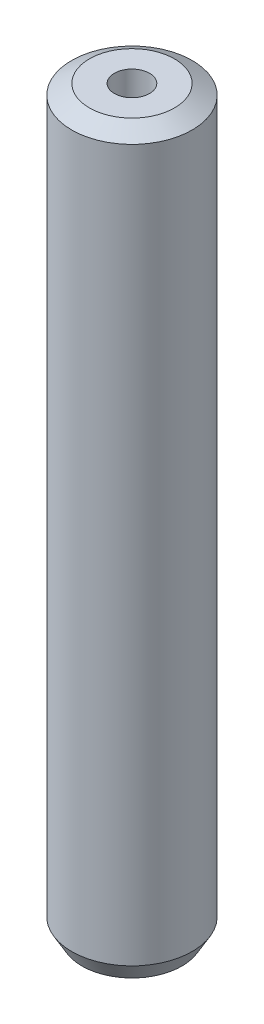
ISO-10303-21;
HEADER;
FILE_DESCRIPTION(('STEP AP214'),'2;1');
FILE_NAME('part.step','',(''),(''),'','','');
FILE_SCHEMA(('AUTOMOTIVE_DESIGN { 1 0 10303 214 1 1 1 1 }'));
ENDSEC;
DATA;
#1=APPLICATION_CONTEXT('core data for automotive mechanical design processes');
#2=APPLICATION_PROTOCOL_DEFINITION('international standard','automotive_design',2000,#1);
#3=PRODUCT_CONTEXT('',#1,'mechanical');
#4=PRODUCT('Part','Part','',(#3));
#5=PRODUCT_RELATED_PRODUCT_CATEGORY('part','',(#4));
#6=PRODUCT_DEFINITION_FORMATION('','',#4);
#7=PRODUCT_DEFINITION_CONTEXT('part definition',#1,'design');
#8=PRODUCT_DEFINITION('design','',#6,#7);
#9=PRODUCT_DEFINITION_SHAPE('','',#8);
#10=(LENGTH_UNIT() NAMED_UNIT(*) SI_UNIT(.MILLI.,.METRE.));
#11=(NAMED_UNIT(*) PLANE_ANGLE_UNIT() SI_UNIT($,.RADIAN.));
#12=(NAMED_UNIT(*) SI_UNIT($,.STERADIAN.) SOLID_ANGLE_UNIT());
#13=UNCERTAINTY_MEASURE_WITH_UNIT(LENGTH_MEASURE(1.E-05),#10,'distance_accuracy_value','');
#14=(GEOMETRIC_REPRESENTATION_CONTEXT(3) GLOBAL_UNCERTAINTY_ASSIGNED_CONTEXT((#13)) GLOBAL_UNIT_ASSIGNED_CONTEXT((#10,
#11,#12)) REPRESENTATION_CONTEXT('',''));
#15=CARTESIAN_POINT('',(0.,0.,0.));
#16=DIRECTION('',(0.,0.,1.));
#17=DIRECTION('',(1.,0.,0.));
#18=AXIS2_PLACEMENT_3D('',#15,#16,#17);
#19=CARTESIAN_POINT('',(0.,337.421841932297,0.));
#20=DIRECTION('',(0.,-1.,0.));
#21=DIRECTION('',(0.,0.,-1.));
#22=AXIS2_PLACEMENT_3D('',#19,#20,#21);
#23=CYLINDRICAL_SURFACE('',#22,27.5);
#24=CARTESIAN_POINT('',(0.,332.752974863002,0.));
#25=DIRECTION('',(0.,1.,0.));
#26=DIRECTION('',(0.,0.,1.));
#27=AXIS2_PLACEMENT_3D('',#24,#25,#26);
#28=CIRCLE('',#27,27.5);
#29=CARTESIAN_POINT('',(0.,332.752974863002,27.5));
#30=VERTEX_POINT('',#29);
#31=EDGE_CURVE('E50',#30,#30,#28,.F.);
#32=ORIENTED_EDGE('',*,*,#31,.T.);
#33=EDGE_LOOP('',(#32));
#34=FACE_BOUND('',#33,.T.);
#35=CARTESIAN_POINT('',(0.,8.08671497780383,0.));
#36=DIRECTION('',(0.,1.,0.));
#37=DIRECTION('',(0.,0.,1.));
#38=AXIS2_PLACEMENT_3D('',#35,#36,#37);
#39=CIRCLE('',#38,27.5);
#40=CARTESIAN_POINT('',(0.,8.08671497780383,27.5));
#41=VERTEX_POINT('',#40);
#42=EDGE_CURVE('E51',#41,#41,#39,.T.);
#43=ORIENTED_EDGE('',*,*,#42,.T.);
#44=EDGE_LOOP('',(#43));
#45=FACE_BOUND('',#44,.T.);
#46=ADVANCED_FACE('F39',(#34,#45),#23,.T.);
#47=CARTESIAN_POINT('',(0.,337.421841932297,0.));
#48=DIRECTION('',(0.,1.,0.));
#49=DIRECTION('',(0.,0.,1.));
#50=AXIS2_PLACEMENT_3D('',#47,#48,#49);
#51=PLANE('',#50);
#52=CARTESIAN_POINT('',(0.,337.421841932297,0.));
#53=DIRECTION('',(0.,1.,0.));
#54=DIRECTION('',(0.,0.,1.));
#55=AXIS2_PLACEMENT_3D('',#52,#53,#54);
#56=CIRCLE('',#55,19.4132850221964);
#57=CARTESIAN_POINT('',(0.,337.421841932297,19.4132850221964));
#58=VERTEX_POINT('',#57);
#59=EDGE_CURVE('E54',#58,#58,#56,.T.);
#60=ORIENTED_EDGE('',*,*,#59,.T.);
#61=EDGE_LOOP('',(#60));
#62=FACE_BOUND('',#61,.T.);
#63=CARTESIAN_POINT('',(0.,337.421841932297,0.));
#64=DIRECTION('',(0.,1.,0.));
#65=DIRECTION('',(0.,0.,1.));
#66=AXIS2_PLACEMENT_3D('',#63,#64,#65);
#67=CIRCLE('',#66,8.02799766468584);
#68=CARTESIAN_POINT('',(0.,337.421841932297,8.02799766468584));
#69=VERTEX_POINT('',#68);
#70=EDGE_CURVE('E58',#69,#69,#67,.T.);
#71=ORIENTED_EDGE('',*,*,#70,.F.);
#72=EDGE_LOOP('',(#71));
#73=FACE_BOUND('',#72,.T.);
#74=ADVANCED_FACE('F69',(#62,#73),#51,.T.);
#75=CARTESIAN_POINT('',(0.,0.,0.));
#76=DIRECTION('',(0.,1.,0.));
#77=DIRECTION('',(0.,0.,1.));
#78=AXIS2_PLACEMENT_3D('',#75,#76,#77);
#79=PLANE('',#78);
#80=CARTESIAN_POINT('',(0.,0.,0.));
#81=DIRECTION('',(0.,1.,0.));
#82=DIRECTION('',(0.,0.,1.));
#83=AXIS2_PLACEMENT_3D('',#80,#81,#82);
#84=CIRCLE('',#83,22.8311329307051);
#85=CARTESIAN_POINT('',(0.,0.,22.8311329307051));
#86=VERTEX_POINT('',#85);
#87=EDGE_CURVE('E10',#86,#86,#84,.F.);
#88=ORIENTED_EDGE('',*,*,#87,.T.);
#89=EDGE_LOOP('',(#88));
#90=FACE_BOUND('',#89,.T.);
#91=CARTESIAN_POINT('',(0.,0.,0.));
#92=DIRECTION('',(0.,1.,0.));
#93=DIRECTION('',(0.,0.,1.));
#94=AXIS2_PLACEMENT_3D('',#91,#92,#93);
#95=CIRCLE('',#94,8.02799766468584);
#96=CARTESIAN_POINT('',(0.,0.,8.02799766468584));
#97=VERTEX_POINT('',#96);
#98=EDGE_CURVE('E63',#97,#97,#95,.T.);
#99=ORIENTED_EDGE('',*,*,#98,.T.);
#100=EDGE_LOOP('',(#99));
#101=FACE_BOUND('',#100,.T.);
#102=ADVANCED_FACE('F75',(#90,#101),#79,.F.);
#103=CARTESIAN_POINT('',(0.,337.421841932297,0.));
#104=DIRECTION('',(0.,-1.,0.));
#105=DIRECTION('',(0.,0.,-1.));
#106=AXIS2_PLACEMENT_3D('',#103,#104,#105);
#107=CYLINDRICAL_SURFACE('',#106,8.02799766468584);
#108=ORIENTED_EDGE('',*,*,#70,.T.);
#109=EDGE_LOOP('',(#108));
#110=FACE_BOUND('',#109,.T.);
#111=ORIENTED_EDGE('',*,*,#98,.F.);
#112=EDGE_LOOP('',(#111));
#113=FACE_BOUND('',#112,.T.);
#114=ADVANCED_FACE('F70',(#110,#113),#107,.F.);
#115=CARTESIAN_POINT('',(0.,337.421841932297,0.));
#116=DIRECTION('',(0.,-1.,0.));
#117=DIRECTION('',(0.,0.,-1.));
#118=AXIS2_PLACEMENT_3D('',#115,#116,#117);
#119=CONICAL_SURFACE('',#118,19.4132850221964,1.0471975511966);
#120=ORIENTED_EDGE('',*,*,#31,.F.);
#121=EDGE_LOOP('',(#120));
#122=FACE_BOUND('',#121,.T.);
#123=ORIENTED_EDGE('',*,*,#59,.F.);
#124=EDGE_LOOP('',(#123));
#125=FACE_BOUND('',#124,.T.);
#126=ADVANCED_FACE('F81',(#122,#125),#119,.T.);
#127=CARTESIAN_POINT('',(0.,8.08671497780383,0.));
#128=DIRECTION('',(0.,1.,0.));
#129=DIRECTION('',(0.,0.,1.));
#130=AXIS2_PLACEMENT_3D('',#127,#128,#129);
#131=CONICAL_SURFACE('',#130,27.5,0.523598775598304);
#132=ORIENTED_EDGE('',*,*,#87,.F.);
#133=EDGE_LOOP('',(#132));
#134=FACE_BOUND('',#133,.T.);
#135=ORIENTED_EDGE('',*,*,#42,.F.);
#136=EDGE_LOOP('',(#135));
#137=FACE_BOUND('',#136,.T.);
#138=ADVANCED_FACE('F45',(#134,#137),#131,.T.);
#139=CLOSED_SHELL('',(#46,#74,#102,#114,#126,#138));
#140=MANIFOLD_SOLID_BREP('B2',#139);
#141=ADVANCED_BREP_SHAPE_REPRESENTATION('',(#18,#140),#14);
#142=SHAPE_DEFINITION_REPRESENTATION(#9,#141);
ENDSEC;
END-ISO-10303-21;
